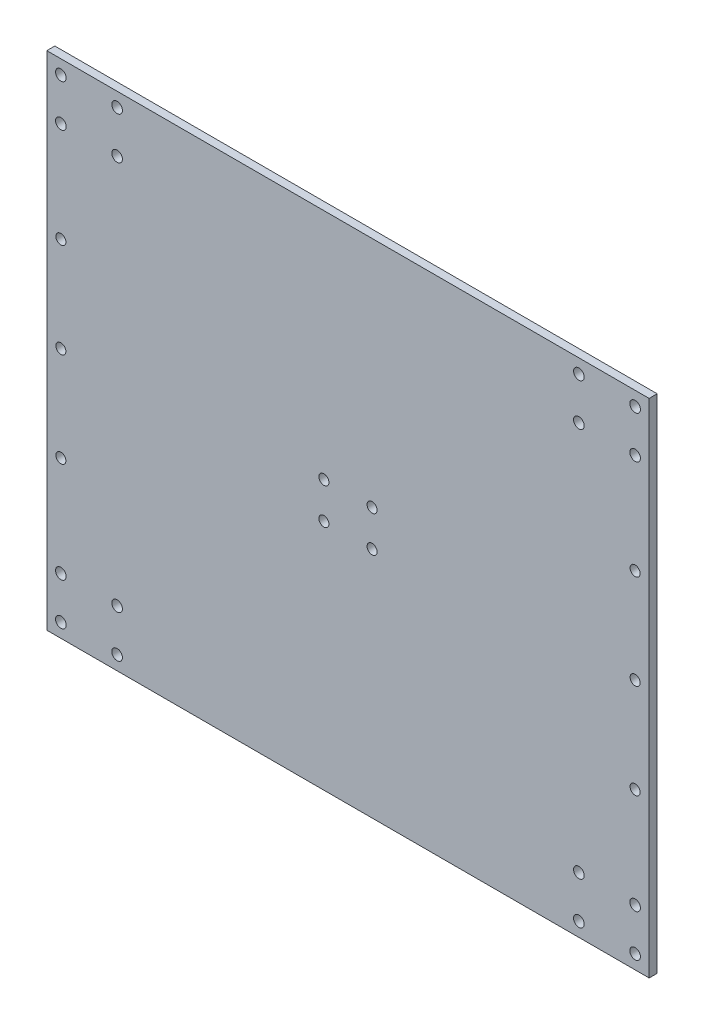
ISO-10303-21;
HEADER;
FILE_DESCRIPTION(('STEP AP214'),'2;1');
FILE_NAME('part.step','',(''),(''),'','','');
FILE_SCHEMA(('AUTOMOTIVE_DESIGN { 1 0 10303 214 1 1 1 1 }'));
ENDSEC;
DATA;
#1=APPLICATION_CONTEXT('core data for automotive mechanical design processes');
#2=APPLICATION_PROTOCOL_DEFINITION('international standard','automotive_design',2000,#1);
#3=PRODUCT_CONTEXT('',#1,'mechanical');
#4=PRODUCT('Part','Part','',(#3));
#5=PRODUCT_RELATED_PRODUCT_CATEGORY('part','',(#4));
#6=PRODUCT_DEFINITION_FORMATION('','',#4);
#7=PRODUCT_DEFINITION_CONTEXT('part definition',#1,'design');
#8=PRODUCT_DEFINITION('design','',#6,#7);
#9=PRODUCT_DEFINITION_SHAPE('','',#8);
#10=(LENGTH_UNIT() NAMED_UNIT(*) SI_UNIT(.MILLI.,.METRE.));
#11=(NAMED_UNIT(*) PLANE_ANGLE_UNIT() SI_UNIT($,.RADIAN.));
#12=(NAMED_UNIT(*) SI_UNIT($,.STERADIAN.) SOLID_ANGLE_UNIT());
#13=UNCERTAINTY_MEASURE_WITH_UNIT(LENGTH_MEASURE(1.E-05),#10,'distance_accuracy_value','');
#14=(GEOMETRIC_REPRESENTATION_CONTEXT(3) GLOBAL_UNCERTAINTY_ASSIGNED_CONTEXT((#13)) GLOBAL_UNIT_ASSIGNED_CONTEXT((#10,
#11,#12)) REPRESENTATION_CONTEXT('',''));
#15=CARTESIAN_POINT('',(0.,0.,0.));
#16=DIRECTION('',(0.,0.,1.));
#17=DIRECTION('',(1.,0.,0.));
#18=AXIS2_PLACEMENT_3D('',#15,#16,#17);
#19=CARTESIAN_POINT('',(0.,0.,4.));
#20=DIRECTION('',(0.,0.,-1.));
#21=DIRECTION('',(-1.,0.,0.));
#22=AXIS2_PLACEMENT_3D('',#19,#20,#21);
#23=PLANE('',#22);
#24=DIRECTION('',(0.,-1.,0.));
#25=VECTOR('',#24,1.);
#26=CARTESIAN_POINT('',(0.,0.,4.));
#27=LINE('',#26,#25);
#28=CARTESIAN_POINT('',(0.,250.,4.));
#29=VERTEX_POINT('',#28);
#30=CARTESIAN_POINT('',(0.,0.,4.));
#31=VERTEX_POINT('',#30);
#32=EDGE_CURVE('E88',#29,#31,#27,.T.);
#33=ORIENTED_EDGE('',*,*,#32,.T.);
#34=DIRECTION('',(1.,0.,0.));
#35=VECTOR('',#34,1.);
#36=CARTESIAN_POINT('',(0.,0.,4.));
#37=LINE('',#36,#35);
#38=CARTESIAN_POINT('',(300.000000000001,0.,4.));
#39=VERTEX_POINT('',#38);
#40=EDGE_CURVE('E83',#31,#39,#37,.T.);
#41=ORIENTED_EDGE('',*,*,#40,.T.);
#42=DIRECTION('',(0.,1.,0.));
#43=VECTOR('',#42,1.);
#44=CARTESIAN_POINT('',(300.000000000001,0.,4.));
#45=LINE('',#44,#43);
#46=CARTESIAN_POINT('',(300.000000000001,250.,4.));
#47=VERTEX_POINT('',#46);
#48=EDGE_CURVE('E86',#39,#47,#45,.T.);
#49=ORIENTED_EDGE('',*,*,#48,.T.);
#50=DIRECTION('',(-1.,0.,0.));
#51=VECTOR('',#50,1.);
#52=CARTESIAN_POINT('',(0.,250.,4.));
#53=LINE('',#52,#51);
#54=EDGE_CURVE('E53',#47,#29,#53,.T.);
#55=ORIENTED_EDGE('',*,*,#54,.T.);
#56=EDGE_LOOP('',(#33,#41,#49,#55));
#57=FACE_BOUND('',#56,.T.);
#58=CARTESIAN_POINT('',(293.000000000611,243.000000000048,4.));
#59=DIRECTION('',(0.,0.,1.));
#60=DIRECTION('',(1.,0.,0.));
#61=AXIS2_PLACEMENT_3D('',#58,#59,#60);
#62=CIRCLE('',#61,2.64999999944384);
#63=CARTESIAN_POINT('',(295.650000000055,243.000000000048,4.));
#64=VERTEX_POINT('',#63);
#65=EDGE_CURVE('E103',#64,#64,#62,.T.);
#66=ORIENTED_EDGE('',*,*,#65,.F.);
#67=EDGE_LOOP('',(#66));
#68=FACE_BOUND('',#67,.T.);
#69=CARTESIAN_POINT('',(265.000000000611,243.000000000048,4.));
#70=DIRECTION('',(0.,0.,1.));
#71=DIRECTION('',(1.,0.,0.));
#72=AXIS2_PLACEMENT_3D('',#69,#70,#71);
#73=CIRCLE('',#72,2.64999999944384);
#74=CARTESIAN_POINT('',(267.650000000055,243.000000000048,4.));
#75=VERTEX_POINT('',#74);
#76=EDGE_CURVE('E118',#75,#75,#73,.T.);
#77=ORIENTED_EDGE('',*,*,#76,.F.);
#78=EDGE_LOOP('',(#77));
#79=FACE_BOUND('',#78,.T.);
#80=CARTESIAN_POINT('',(265.000000000612,222.000000000048,4.));
#81=DIRECTION('',(0.,0.,1.));
#82=DIRECTION('',(1.,0.,0.));
#83=AXIS2_PLACEMENT_3D('',#80,#81,#82);
#84=CIRCLE('',#83,2.64999999944384);
#85=CARTESIAN_POINT('',(267.650000000055,222.000000000048,4.));
#86=VERTEX_POINT('',#85);
#87=EDGE_CURVE('E124',#86,#86,#84,.T.);
#88=ORIENTED_EDGE('',*,*,#87,.F.);
#89=EDGE_LOOP('',(#88));
#90=FACE_BOUND('',#89,.T.);
#91=CARTESIAN_POINT('',(293.000000000612,222.000000000048,4.));
#92=DIRECTION('',(0.,0.,1.));
#93=DIRECTION('',(1.,0.,0.));
#94=AXIS2_PLACEMENT_3D('',#91,#92,#93);
#95=CIRCLE('',#94,2.64999999944372);
#96=CARTESIAN_POINT('',(295.650000000055,222.000000000048,4.));
#97=VERTEX_POINT('',#96);
#98=EDGE_CURVE('E130',#97,#97,#95,.T.);
#99=ORIENTED_EDGE('',*,*,#98,.F.);
#100=EDGE_LOOP('',(#99));
#101=FACE_BOUND('',#100,.T.);
#102=CARTESIAN_POINT('',(35.0000000004003,243.,4.));
#103=DIRECTION('',(0.,0.,1.));
#104=DIRECTION('',(1.,0.,0.));
#105=AXIS2_PLACEMENT_3D('',#102,#103,#104);
#106=CIRCLE('',#105,2.64999999964641);
#107=CARTESIAN_POINT('',(37.6500000000467,243.,4.));
#108=VERTEX_POINT('',#107);
#109=EDGE_CURVE('E136',#108,#108,#106,.T.);
#110=ORIENTED_EDGE('',*,*,#109,.F.);
#111=EDGE_LOOP('',(#110));
#112=FACE_BOUND('',#111,.T.);
#113=CARTESIAN_POINT('',(7.00000000040029,243.,4.));
#114=DIRECTION('',(0.,0.,1.));
#115=DIRECTION('',(1.,0.,0.));
#116=AXIS2_PLACEMENT_3D('',#113,#114,#115);
#117=CIRCLE('',#116,2.64999999964631);
#118=CARTESIAN_POINT('',(9.65000000004659,243.,4.));
#119=VERTEX_POINT('',#118);
#120=EDGE_CURVE('E142',#119,#119,#117,.T.);
#121=ORIENTED_EDGE('',*,*,#120,.F.);
#122=EDGE_LOOP('',(#121));
#123=FACE_BOUND('',#122,.T.);
#124=CARTESIAN_POINT('',(7.00000000040028,222.,4.));
#125=DIRECTION('',(0.,0.,1.));
#126=DIRECTION('',(1.,0.,0.));
#127=AXIS2_PLACEMENT_3D('',#124,#125,#126);
#128=CIRCLE('',#127,2.64999999964628);
#129=CARTESIAN_POINT('',(9.65000000004656,222.,4.));
#130=VERTEX_POINT('',#129);
#131=EDGE_CURVE('E148',#130,#130,#128,.T.);
#132=ORIENTED_EDGE('',*,*,#131,.F.);
#133=EDGE_LOOP('',(#132));
#134=FACE_BOUND('',#133,.T.);
#135=CARTESIAN_POINT('',(35.0000000004003,222.,4.));
#136=DIRECTION('',(0.,0.,1.));
#137=DIRECTION('',(1.,0.,0.));
#138=AXIS2_PLACEMENT_3D('',#135,#136,#137);
#139=CIRCLE('',#138,2.64999999964628);
#140=CARTESIAN_POINT('',(37.6500000000466,222.,4.));
#141=VERTEX_POINT('',#140);
#142=EDGE_CURVE('E154',#141,#141,#139,.T.);
#143=ORIENTED_EDGE('',*,*,#142,.F.);
#144=EDGE_LOOP('',(#143));
#145=FACE_BOUND('',#144,.T.);
#146=CARTESIAN_POINT('',(7.00000000040292,28.0000000000002,4.));
#147=DIRECTION('',(0.,0.,1.));
#148=DIRECTION('',(1.,0.,0.));
#149=AXIS2_PLACEMENT_3D('',#146,#147,#148);
#150=CIRCLE('',#149,2.6499999996439);
#151=CARTESIAN_POINT('',(9.65000000004682,28.0000000000002,4.));
#152=VERTEX_POINT('',#151);
#153=EDGE_CURVE('E160',#152,#152,#150,.T.);
#154=ORIENTED_EDGE('',*,*,#153,.F.);
#155=EDGE_LOOP('',(#154));
#156=FACE_BOUND('',#155,.T.);
#157=CARTESIAN_POINT('',(7.00000000040292,7.00000000000018,4.));
#158=DIRECTION('',(0.,0.,1.));
#159=DIRECTION('',(1.,0.,0.));
#160=AXIS2_PLACEMENT_3D('',#157,#158,#159);
#161=CIRCLE('',#160,2.6499999996439);
#162=CARTESIAN_POINT('',(9.65000000004682,7.00000000000018,4.));
#163=VERTEX_POINT('',#162);
#164=EDGE_CURVE('E166',#163,#163,#161,.T.);
#165=ORIENTED_EDGE('',*,*,#164,.F.);
#166=EDGE_LOOP('',(#165));
#167=FACE_BOUND('',#166,.T.);
#168=CARTESIAN_POINT('',(35.0000000004029,7.00000000000017,4.));
#169=DIRECTION('',(0.,0.,1.));
#170=DIRECTION('',(1.,0.,0.));
#171=AXIS2_PLACEMENT_3D('',#168,#169,#170);
#172=CIRCLE('',#171,2.6499999996438);
#173=CARTESIAN_POINT('',(37.6500000000467,7.00000000000017,4.));
#174=VERTEX_POINT('',#173);
#175=EDGE_CURVE('E172',#174,#174,#172,.T.);
#176=ORIENTED_EDGE('',*,*,#175,.F.);
#177=EDGE_LOOP('',(#176));
#178=FACE_BOUND('',#177,.T.);
#179=CARTESIAN_POINT('',(35.0000000004029,28.0000000000002,4.));
#180=DIRECTION('',(0.,0.,1.));
#181=DIRECTION('',(1.,0.,0.));
#182=AXIS2_PLACEMENT_3D('',#179,#180,#181);
#183=CIRCLE('',#182,2.6499999996439);
#184=CARTESIAN_POINT('',(37.6500000000468,28.0000000000002,4.));
#185=VERTEX_POINT('',#184);
#186=EDGE_CURVE('E178',#185,#185,#183,.T.);
#187=ORIENTED_EDGE('',*,*,#186,.F.);
#188=EDGE_LOOP('',(#187));
#189=FACE_BOUND('',#188,.T.);
#190=CARTESIAN_POINT('',(265.000000000404,28.0000000000002,4.));
#191=DIRECTION('',(0.,0.,1.));
#192=DIRECTION('',(1.,0.,0.));
#193=AXIS2_PLACEMENT_3D('',#190,#191,#192);
#194=CIRCLE('',#193,2.64999999964333);
#195=CARTESIAN_POINT('',(267.650000000047,28.0000000000002,4.));
#196=VERTEX_POINT('',#195);
#197=EDGE_CURVE('E184',#196,#196,#194,.T.);
#198=ORIENTED_EDGE('',*,*,#197,.F.);
#199=EDGE_LOOP('',(#198));
#200=FACE_BOUND('',#199,.T.);
#201=CARTESIAN_POINT('',(265.000000000404,7.00000000000018,4.));
#202=DIRECTION('',(0.,0.,1.));
#203=DIRECTION('',(1.,0.,0.));
#204=AXIS2_PLACEMENT_3D('',#201,#202,#203);
#205=CIRCLE('',#204,2.64999999964332);
#206=CARTESIAN_POINT('',(267.650000000047,7.00000000000018,4.));
#207=VERTEX_POINT('',#206);
#208=EDGE_CURVE('E190',#207,#207,#205,.T.);
#209=ORIENTED_EDGE('',*,*,#208,.F.);
#210=EDGE_LOOP('',(#209));
#211=FACE_BOUND('',#210,.T.);
#212=CARTESIAN_POINT('',(293.000000000403,7.00000000000018,4.));
#213=DIRECTION('',(0.,0.,1.));
#214=DIRECTION('',(1.,0.,0.));
#215=AXIS2_PLACEMENT_3D('',#212,#213,#214);
#216=CIRCLE('',#215,2.64999999964349);
#217=CARTESIAN_POINT('',(295.650000000047,7.00000000000018,4.));
#218=VERTEX_POINT('',#217);
#219=EDGE_CURVE('E196',#218,#218,#216,.T.);
#220=ORIENTED_EDGE('',*,*,#219,.F.);
#221=EDGE_LOOP('',(#220));
#222=FACE_BOUND('',#221,.T.);
#223=CARTESIAN_POINT('',(293.000000000403,28.0000000000002,4.));
#224=DIRECTION('',(0.,0.,1.));
#225=DIRECTION('',(1.,0.,0.));
#226=AXIS2_PLACEMENT_3D('',#223,#224,#225);
#227=CIRCLE('',#226,2.64999999964349);
#228=CARTESIAN_POINT('',(295.650000000047,28.0000000000002,4.));
#229=VERTEX_POINT('',#228);
#230=EDGE_CURVE('E202',#229,#229,#227,.T.);
#231=ORIENTED_EDGE('',*,*,#230,.F.);
#232=EDGE_LOOP('',(#231));
#233=FACE_BOUND('',#232,.T.);
#234=CARTESIAN_POINT('',(162.000000000066,134.,4.));
#235=DIRECTION('',(0.,0.,1.));
#236=DIRECTION('',(1.,0.,0.));
#237=AXIS2_PLACEMENT_3D('',#234,#235,#236);
#238=CIRCLE('',#237,2.4999999999388);
#239=CARTESIAN_POINT('',(164.500000000005,134.,4.));
#240=VERTEX_POINT('',#239);
#241=EDGE_CURVE('E208',#240,#240,#238,.T.);
#242=ORIENTED_EDGE('',*,*,#241,.F.);
#243=EDGE_LOOP('',(#242));
#244=FACE_BOUND('',#243,.T.);
#245=CARTESIAN_POINT('',(138.000000000066,134.,4.));
#246=DIRECTION('',(0.,0.,1.));
#247=DIRECTION('',(1.,0.,0.));
#248=AXIS2_PLACEMENT_3D('',#245,#246,#247);
#249=CIRCLE('',#248,2.49999999993801);
#250=CARTESIAN_POINT('',(140.500000000004,134.,4.));
#251=VERTEX_POINT('',#250);
#252=EDGE_CURVE('E214',#251,#251,#249,.T.);
#253=ORIENTED_EDGE('',*,*,#252,.F.);
#254=EDGE_LOOP('',(#253));
#255=FACE_BOUND('',#254,.T.);
#256=CARTESIAN_POINT('',(138.000000000066,116.,4.));
#257=DIRECTION('',(0.,0.,1.));
#258=DIRECTION('',(1.,0.,0.));
#259=AXIS2_PLACEMENT_3D('',#256,#257,#258);
#260=CIRCLE('',#259,2.49999999993862);
#261=CARTESIAN_POINT('',(140.500000000004,116.,4.));
#262=VERTEX_POINT('',#261);
#263=EDGE_CURVE('E220',#262,#262,#260,.T.);
#264=ORIENTED_EDGE('',*,*,#263,.F.);
#265=EDGE_LOOP('',(#264));
#266=FACE_BOUND('',#265,.T.);
#267=CARTESIAN_POINT('',(161.999999999865,115.999999999977,4.));
#268=DIRECTION('',(0.,0.,1.));
#269=DIRECTION('',(1.,0.,0.));
#270=AXIS2_PLACEMENT_3D('',#267,#268,#269);
#271=CIRCLE('',#270,2.50000000013431);
#272=CARTESIAN_POINT('',(164.499999999999,115.999999999977,4.));
#273=VERTEX_POINT('',#272);
#274=EDGE_CURVE('E226',#273,#273,#271,.T.);
#275=ORIENTED_EDGE('',*,*,#274,.F.);
#276=EDGE_LOOP('',(#275));
#277=FACE_BOUND('',#276,.T.);
#278=CARTESIAN_POINT('',(7.00000000000455,125.,4.));
#279=DIRECTION('',(0.,0.,1.));
#280=DIRECTION('',(1.,0.,0.));
#281=AXIS2_PLACEMENT_3D('',#278,#279,#280);
#282=CIRCLE('',#281,2.5);
#283=CARTESIAN_POINT('',(9.50000000000455,125.,4.));
#284=VERTEX_POINT('',#283);
#285=EDGE_CURVE('E232',#284,#284,#282,.T.);
#286=ORIENTED_EDGE('',*,*,#285,.F.);
#287=EDGE_LOOP('',(#286));
#288=FACE_BOUND('',#287,.T.);
#289=CARTESIAN_POINT('',(7.00000000000456,77.8250000000123,4.));
#290=DIRECTION('',(0.,0.,1.));
#291=DIRECTION('',(1.,0.,0.));
#292=AXIS2_PLACEMENT_3D('',#289,#290,#291);
#293=CIRCLE('',#292,2.5);
#294=CARTESIAN_POINT('',(9.50000000000456,77.8250000000123,4.));
#295=VERTEX_POINT('',#294);
#296=EDGE_CURVE('E238',#295,#295,#293,.T.);
#297=ORIENTED_EDGE('',*,*,#296,.F.);
#298=EDGE_LOOP('',(#297));
#299=FACE_BOUND('',#298,.T.);
#300=CARTESIAN_POINT('',(7.00000000000453,172.174999999988,4.));
#301=DIRECTION('',(0.,0.,1.));
#302=DIRECTION('',(1.,0.,0.));
#303=AXIS2_PLACEMENT_3D('',#300,#301,#302);
#304=CIRCLE('',#303,2.5);
#305=CARTESIAN_POINT('',(9.50000000000453,172.174999999988,4.));
#306=VERTEX_POINT('',#305);
#307=EDGE_CURVE('E244',#306,#306,#304,.T.);
#308=ORIENTED_EDGE('',*,*,#307,.F.);
#309=EDGE_LOOP('',(#308));
#310=FACE_BOUND('',#309,.T.);
#311=CARTESIAN_POINT('',(293.000000000007,125.,4.));
#312=DIRECTION('',(0.,0.,1.));
#313=DIRECTION('',(1.,0.,0.));
#314=AXIS2_PLACEMENT_3D('',#311,#312,#313);
#315=CIRCLE('',#314,2.50000000000002);
#316=CARTESIAN_POINT('',(295.500000000007,125.,4.));
#317=VERTEX_POINT('',#316);
#318=EDGE_CURVE('E250',#317,#317,#315,.T.);
#319=ORIENTED_EDGE('',*,*,#318,.F.);
#320=EDGE_LOOP('',(#319));
#321=FACE_BOUND('',#320,.T.);
#322=CARTESIAN_POINT('',(293.000000000007,77.8250000000123,4.));
#323=DIRECTION('',(0.,0.,1.));
#324=DIRECTION('',(1.,0.,0.));
#325=AXIS2_PLACEMENT_3D('',#322,#323,#324);
#326=CIRCLE('',#325,2.50000000000002);
#327=CARTESIAN_POINT('',(295.500000000007,77.8250000000123,4.));
#328=VERTEX_POINT('',#327);
#329=EDGE_CURVE('E256',#328,#328,#326,.T.);
#330=ORIENTED_EDGE('',*,*,#329,.F.);
#331=EDGE_LOOP('',(#330));
#332=FACE_BOUND('',#331,.T.);
#333=CARTESIAN_POINT('',(293.000000000007,172.174999999988,4.));
#334=DIRECTION('',(0.,0.,1.));
#335=DIRECTION('',(1.,0.,0.));
#336=AXIS2_PLACEMENT_3D('',#333,#334,#335);
#337=CIRCLE('',#336,2.50000000000002);
#338=CARTESIAN_POINT('',(295.500000000007,172.174999999988,4.));
#339=VERTEX_POINT('',#338);
#340=EDGE_CURVE('E262',#339,#339,#337,.T.);
#341=ORIENTED_EDGE('',*,*,#340,.F.);
#342=EDGE_LOOP('',(#341));
#343=FACE_BOUND('',#342,.T.);
#344=ADVANCED_FACE('F36',(#57,#68,#79,#90,#101,#112,#123,#134,#145,#156,#167,#178,#189,#200,
#211,#222,#233,#244,#255,#266,#277,#288,#299,#310,#321,#332,#343),#23,.F.);
#345=CARTESIAN_POINT('',(0.,0.,0.));
#346=DIRECTION('',(0.,0.,-1.));
#347=DIRECTION('',(-1.,0.,0.));
#348=AXIS2_PLACEMENT_3D('',#345,#346,#347);
#349=PLANE('',#348);
#350=CARTESIAN_POINT('',(293.000000000007,77.8250000000123,0.));
#351=DIRECTION('',(0.,0.,1.));
#352=DIRECTION('',(1.,0.,0.));
#353=AXIS2_PLACEMENT_3D('',#350,#351,#352);
#354=CIRCLE('',#353,2.50000000000002);
#355=CARTESIAN_POINT('',(295.500000000007,77.8250000000123,0.));
#356=VERTEX_POINT('',#355);
#357=EDGE_CURVE('E259',#356,#356,#354,.T.);
#358=ORIENTED_EDGE('',*,*,#357,.T.);
#359=EDGE_LOOP('',(#358));
#360=FACE_BOUND('',#359,.T.);
#361=CARTESIAN_POINT('',(7.00000000000453,172.174999999988,0.));
#362=DIRECTION('',(0.,0.,1.));
#363=DIRECTION('',(1.,0.,0.));
#364=AXIS2_PLACEMENT_3D('',#361,#362,#363);
#365=CIRCLE('',#364,2.5);
#366=CARTESIAN_POINT('',(9.50000000000453,172.174999999988,0.));
#367=VERTEX_POINT('',#366);
#368=EDGE_CURVE('E247',#367,#367,#365,.T.);
#369=ORIENTED_EDGE('',*,*,#368,.T.);
#370=EDGE_LOOP('',(#369));
#371=FACE_BOUND('',#370,.T.);
#372=CARTESIAN_POINT('',(7.00000000000455,125.,0.));
#373=DIRECTION('',(0.,0.,1.));
#374=DIRECTION('',(1.,0.,0.));
#375=AXIS2_PLACEMENT_3D('',#372,#373,#374);
#376=CIRCLE('',#375,2.5);
#377=CARTESIAN_POINT('',(9.50000000000455,125.,0.));
#378=VERTEX_POINT('',#377);
#379=EDGE_CURVE('E235',#378,#378,#376,.T.);
#380=ORIENTED_EDGE('',*,*,#379,.T.);
#381=EDGE_LOOP('',(#380));
#382=FACE_BOUND('',#381,.T.);
#383=CARTESIAN_POINT('',(138.000000000066,116.,0.));
#384=DIRECTION('',(0.,0.,1.));
#385=DIRECTION('',(1.,0.,0.));
#386=AXIS2_PLACEMENT_3D('',#383,#384,#385);
#387=CIRCLE('',#386,2.49999999993862);
#388=CARTESIAN_POINT('',(140.500000000004,116.,0.));
#389=VERTEX_POINT('',#388);
#390=EDGE_CURVE('E223',#389,#389,#387,.T.);
#391=ORIENTED_EDGE('',*,*,#390,.T.);
#392=EDGE_LOOP('',(#391));
#393=FACE_BOUND('',#392,.T.);
#394=CARTESIAN_POINT('',(162.000000000066,134.,0.));
#395=DIRECTION('',(0.,0.,1.));
#396=DIRECTION('',(1.,0.,0.));
#397=AXIS2_PLACEMENT_3D('',#394,#395,#396);
#398=CIRCLE('',#397,2.4999999999388);
#399=CARTESIAN_POINT('',(164.500000000005,134.,0.));
#400=VERTEX_POINT('',#399);
#401=EDGE_CURVE('E211',#400,#400,#398,.T.);
#402=ORIENTED_EDGE('',*,*,#401,.T.);
#403=EDGE_LOOP('',(#402));
#404=FACE_BOUND('',#403,.T.);
#405=CARTESIAN_POINT('',(293.000000000403,7.00000000000018,0.));
#406=DIRECTION('',(0.,0.,1.));
#407=DIRECTION('',(1.,0.,0.));
#408=AXIS2_PLACEMENT_3D('',#405,#406,#407);
#409=CIRCLE('',#408,2.64999999964349);
#410=CARTESIAN_POINT('',(295.650000000047,7.00000000000018,0.));
#411=VERTEX_POINT('',#410);
#412=EDGE_CURVE('E199',#411,#411,#409,.T.);
#413=ORIENTED_EDGE('',*,*,#412,.T.);
#414=EDGE_LOOP('',(#413));
#415=FACE_BOUND('',#414,.T.);
#416=CARTESIAN_POINT('',(265.000000000404,28.0000000000002,0.));
#417=DIRECTION('',(0.,0.,1.));
#418=DIRECTION('',(1.,0.,0.));
#419=AXIS2_PLACEMENT_3D('',#416,#417,#418);
#420=CIRCLE('',#419,2.64999999964333);
#421=CARTESIAN_POINT('',(267.650000000047,28.0000000000002,0.));
#422=VERTEX_POINT('',#421);
#423=EDGE_CURVE('E187',#422,#422,#420,.T.);
#424=ORIENTED_EDGE('',*,*,#423,.T.);
#425=EDGE_LOOP('',(#424));
#426=FACE_BOUND('',#425,.T.);
#427=CARTESIAN_POINT('',(35.0000000004029,7.00000000000017,0.));
#428=DIRECTION('',(0.,0.,1.));
#429=DIRECTION('',(1.,0.,0.));
#430=AXIS2_PLACEMENT_3D('',#427,#428,#429);
#431=CIRCLE('',#430,2.6499999996438);
#432=CARTESIAN_POINT('',(37.6500000000467,7.00000000000017,0.));
#433=VERTEX_POINT('',#432);
#434=EDGE_CURVE('E175',#433,#433,#431,.T.);
#435=ORIENTED_EDGE('',*,*,#434,.T.);
#436=EDGE_LOOP('',(#435));
#437=FACE_BOUND('',#436,.T.);
#438=CARTESIAN_POINT('',(7.00000000040292,28.0000000000002,0.));
#439=DIRECTION('',(0.,0.,1.));
#440=DIRECTION('',(1.,0.,0.));
#441=AXIS2_PLACEMENT_3D('',#438,#439,#440);
#442=CIRCLE('',#441,2.6499999996439);
#443=CARTESIAN_POINT('',(9.65000000004682,28.0000000000002,0.));
#444=VERTEX_POINT('',#443);
#445=EDGE_CURVE('E163',#444,#444,#442,.T.);
#446=ORIENTED_EDGE('',*,*,#445,.T.);
#447=EDGE_LOOP('',(#446));
#448=FACE_BOUND('',#447,.T.);
#449=CARTESIAN_POINT('',(7.00000000040028,222.,0.));
#450=DIRECTION('',(0.,0.,1.));
#451=DIRECTION('',(1.,0.,0.));
#452=AXIS2_PLACEMENT_3D('',#449,#450,#451);
#453=CIRCLE('',#452,2.64999999964628);
#454=CARTESIAN_POINT('',(9.65000000004656,222.,0.));
#455=VERTEX_POINT('',#454);
#456=EDGE_CURVE('E151',#455,#455,#453,.T.);
#457=ORIENTED_EDGE('',*,*,#456,.T.);
#458=EDGE_LOOP('',(#457));
#459=FACE_BOUND('',#458,.T.);
#460=CARTESIAN_POINT('',(35.0000000004003,243.,0.));
#461=DIRECTION('',(0.,0.,1.));
#462=DIRECTION('',(1.,0.,0.));
#463=AXIS2_PLACEMENT_3D('',#460,#461,#462);
#464=CIRCLE('',#463,2.64999999964641);
#465=CARTESIAN_POINT('',(37.6500000000467,243.,0.));
#466=VERTEX_POINT('',#465);
#467=EDGE_CURVE('E139',#466,#466,#464,.T.);
#468=ORIENTED_EDGE('',*,*,#467,.T.);
#469=EDGE_LOOP('',(#468));
#470=FACE_BOUND('',#469,.T.);
#471=CARTESIAN_POINT('',(265.000000000612,222.000000000048,0.));
#472=DIRECTION('',(0.,0.,1.));
#473=DIRECTION('',(1.,0.,0.));
#474=AXIS2_PLACEMENT_3D('',#471,#472,#473);
#475=CIRCLE('',#474,2.64999999944384);
#476=CARTESIAN_POINT('',(267.650000000055,222.000000000048,0.));
#477=VERTEX_POINT('',#476);
#478=EDGE_CURVE('E127',#477,#477,#475,.T.);
#479=ORIENTED_EDGE('',*,*,#478,.T.);
#480=EDGE_LOOP('',(#479));
#481=FACE_BOUND('',#480,.T.);
#482=CARTESIAN_POINT('',(293.000000000611,243.000000000048,0.));
#483=DIRECTION('',(0.,0.,1.));
#484=DIRECTION('',(1.,0.,0.));
#485=AXIS2_PLACEMENT_3D('',#482,#483,#484);
#486=CIRCLE('',#485,2.64999999944384);
#487=CARTESIAN_POINT('',(295.650000000055,243.000000000048,0.));
#488=VERTEX_POINT('',#487);
#489=EDGE_CURVE('E115',#488,#488,#486,.T.);
#490=ORIENTED_EDGE('',*,*,#489,.T.);
#491=EDGE_LOOP('',(#490));
#492=FACE_BOUND('',#491,.T.);
#493=DIRECTION('',(0.,-1.,0.));
#494=VECTOR('',#493,1.);
#495=CARTESIAN_POINT('',(0.,0.,0.));
#496=LINE('',#495,#494);
#497=CARTESIAN_POINT('',(0.,250.,0.));
#498=VERTEX_POINT('',#497);
#499=CARTESIAN_POINT('',(0.,0.,0.));
#500=VERTEX_POINT('',#499);
#501=EDGE_CURVE('E100',#498,#500,#496,.T.);
#502=ORIENTED_EDGE('',*,*,#501,.F.);
#503=DIRECTION('',(-1.,0.,0.));
#504=VECTOR('',#503,1.);
#505=CARTESIAN_POINT('',(0.,250.,0.));
#506=LINE('',#505,#504);
#507=CARTESIAN_POINT('',(300.000000000001,250.,0.));
#508=VERTEX_POINT('',#507);
#509=EDGE_CURVE('E76',#508,#498,#506,.T.);
#510=ORIENTED_EDGE('',*,*,#509,.F.);
#511=DIRECTION('',(0.,1.,0.));
#512=VECTOR('',#511,1.);
#513=CARTESIAN_POINT('',(300.000000000001,0.,0.));
#514=LINE('',#513,#512);
#515=CARTESIAN_POINT('',(300.000000000001,0.,0.));
#516=VERTEX_POINT('',#515);
#517=EDGE_CURVE('E70',#516,#508,#514,.T.);
#518=ORIENTED_EDGE('',*,*,#517,.F.);
#519=DIRECTION('',(1.,0.,0.));
#520=VECTOR('',#519,1.);
#521=CARTESIAN_POINT('',(0.,0.,0.));
#522=LINE('',#521,#520);
#523=EDGE_CURVE('E92',#500,#516,#522,.T.);
#524=ORIENTED_EDGE('',*,*,#523,.F.);
#525=EDGE_LOOP('',(#502,#510,#518,#524));
#526=FACE_BOUND('',#525,.T.);
#527=CARTESIAN_POINT('',(265.000000000611,243.000000000048,0.));
#528=DIRECTION('',(0.,0.,1.));
#529=DIRECTION('',(1.,0.,0.));
#530=AXIS2_PLACEMENT_3D('',#527,#528,#529);
#531=CIRCLE('',#530,2.64999999944384);
#532=CARTESIAN_POINT('',(267.650000000055,243.000000000048,0.));
#533=VERTEX_POINT('',#532);
#534=EDGE_CURVE('E121',#533,#533,#531,.T.);
#535=ORIENTED_EDGE('',*,*,#534,.T.);
#536=EDGE_LOOP('',(#535));
#537=FACE_BOUND('',#536,.T.);
#538=CARTESIAN_POINT('',(293.000000000612,222.000000000048,0.));
#539=DIRECTION('',(0.,0.,1.));
#540=DIRECTION('',(1.,0.,0.));
#541=AXIS2_PLACEMENT_3D('',#538,#539,#540);
#542=CIRCLE('',#541,2.64999999944372);
#543=CARTESIAN_POINT('',(295.650000000055,222.000000000048,0.));
#544=VERTEX_POINT('',#543);
#545=EDGE_CURVE('E133',#544,#544,#542,.T.);
#546=ORIENTED_EDGE('',*,*,#545,.T.);
#547=EDGE_LOOP('',(#546));
#548=FACE_BOUND('',#547,.T.);
#549=CARTESIAN_POINT('',(7.00000000040029,243.,0.));
#550=DIRECTION('',(0.,0.,1.));
#551=DIRECTION('',(1.,0.,0.));
#552=AXIS2_PLACEMENT_3D('',#549,#550,#551);
#553=CIRCLE('',#552,2.64999999964631);
#554=CARTESIAN_POINT('',(9.65000000004659,243.,0.));
#555=VERTEX_POINT('',#554);
#556=EDGE_CURVE('E145',#555,#555,#553,.T.);
#557=ORIENTED_EDGE('',*,*,#556,.T.);
#558=EDGE_LOOP('',(#557));
#559=FACE_BOUND('',#558,.T.);
#560=CARTESIAN_POINT('',(35.0000000004003,222.,0.));
#561=DIRECTION('',(0.,0.,1.));
#562=DIRECTION('',(1.,0.,0.));
#563=AXIS2_PLACEMENT_3D('',#560,#561,#562);
#564=CIRCLE('',#563,2.64999999964628);
#565=CARTESIAN_POINT('',(37.6500000000466,222.,0.));
#566=VERTEX_POINT('',#565);
#567=EDGE_CURVE('E157',#566,#566,#564,.T.);
#568=ORIENTED_EDGE('',*,*,#567,.T.);
#569=EDGE_LOOP('',(#568));
#570=FACE_BOUND('',#569,.T.);
#571=CARTESIAN_POINT('',(7.00000000040292,7.00000000000018,0.));
#572=DIRECTION('',(0.,0.,1.));
#573=DIRECTION('',(1.,0.,0.));
#574=AXIS2_PLACEMENT_3D('',#571,#572,#573);
#575=CIRCLE('',#574,2.6499999996439);
#576=CARTESIAN_POINT('',(9.65000000004682,7.00000000000018,0.));
#577=VERTEX_POINT('',#576);
#578=EDGE_CURVE('E169',#577,#577,#575,.T.);
#579=ORIENTED_EDGE('',*,*,#578,.T.);
#580=EDGE_LOOP('',(#579));
#581=FACE_BOUND('',#580,.T.);
#582=CARTESIAN_POINT('',(35.0000000004029,28.0000000000002,0.));
#583=DIRECTION('',(0.,0.,1.));
#584=DIRECTION('',(1.,0.,0.));
#585=AXIS2_PLACEMENT_3D('',#582,#583,#584);
#586=CIRCLE('',#585,2.6499999996439);
#587=CARTESIAN_POINT('',(37.6500000000468,28.0000000000002,0.));
#588=VERTEX_POINT('',#587);
#589=EDGE_CURVE('E181',#588,#588,#586,.T.);
#590=ORIENTED_EDGE('',*,*,#589,.T.);
#591=EDGE_LOOP('',(#590));
#592=FACE_BOUND('',#591,.T.);
#593=CARTESIAN_POINT('',(265.000000000404,7.00000000000018,0.));
#594=DIRECTION('',(0.,0.,1.));
#595=DIRECTION('',(1.,0.,0.));
#596=AXIS2_PLACEMENT_3D('',#593,#594,#595);
#597=CIRCLE('',#596,2.64999999964332);
#598=CARTESIAN_POINT('',(267.650000000047,7.00000000000018,0.));
#599=VERTEX_POINT('',#598);
#600=EDGE_CURVE('E193',#599,#599,#597,.T.);
#601=ORIENTED_EDGE('',*,*,#600,.T.);
#602=EDGE_LOOP('',(#601));
#603=FACE_BOUND('',#602,.T.);
#604=CARTESIAN_POINT('',(293.000000000403,28.0000000000002,0.));
#605=DIRECTION('',(0.,0.,1.));
#606=DIRECTION('',(1.,0.,0.));
#607=AXIS2_PLACEMENT_3D('',#604,#605,#606);
#608=CIRCLE('',#607,2.64999999964349);
#609=CARTESIAN_POINT('',(295.650000000047,28.0000000000002,0.));
#610=VERTEX_POINT('',#609);
#611=EDGE_CURVE('E205',#610,#610,#608,.T.);
#612=ORIENTED_EDGE('',*,*,#611,.T.);
#613=EDGE_LOOP('',(#612));
#614=FACE_BOUND('',#613,.T.);
#615=CARTESIAN_POINT('',(138.000000000066,134.,0.));
#616=DIRECTION('',(0.,0.,1.));
#617=DIRECTION('',(1.,0.,0.));
#618=AXIS2_PLACEMENT_3D('',#615,#616,#617);
#619=CIRCLE('',#618,2.49999999993801);
#620=CARTESIAN_POINT('',(140.500000000004,134.,0.));
#621=VERTEX_POINT('',#620);
#622=EDGE_CURVE('E217',#621,#621,#619,.T.);
#623=ORIENTED_EDGE('',*,*,#622,.T.);
#624=EDGE_LOOP('',(#623));
#625=FACE_BOUND('',#624,.T.);
#626=CARTESIAN_POINT('',(161.999999999865,115.999999999977,0.));
#627=DIRECTION('',(0.,0.,1.));
#628=DIRECTION('',(1.,0.,0.));
#629=AXIS2_PLACEMENT_3D('',#626,#627,#628);
#630=CIRCLE('',#629,2.50000000013431);
#631=CARTESIAN_POINT('',(164.499999999999,115.999999999977,0.));
#632=VERTEX_POINT('',#631);
#633=EDGE_CURVE('E229',#632,#632,#630,.T.);
#634=ORIENTED_EDGE('',*,*,#633,.T.);
#635=EDGE_LOOP('',(#634));
#636=FACE_BOUND('',#635,.T.);
#637=CARTESIAN_POINT('',(7.00000000000456,77.8250000000123,0.));
#638=DIRECTION('',(0.,0.,1.));
#639=DIRECTION('',(1.,0.,0.));
#640=AXIS2_PLACEMENT_3D('',#637,#638,#639);
#641=CIRCLE('',#640,2.5);
#642=CARTESIAN_POINT('',(9.50000000000456,77.8250000000123,0.));
#643=VERTEX_POINT('',#642);
#644=EDGE_CURVE('E241',#643,#643,#641,.T.);
#645=ORIENTED_EDGE('',*,*,#644,.T.);
#646=EDGE_LOOP('',(#645));
#647=FACE_BOUND('',#646,.T.);
#648=CARTESIAN_POINT('',(293.000000000007,125.,0.));
#649=DIRECTION('',(0.,0.,1.));
#650=DIRECTION('',(1.,0.,0.));
#651=AXIS2_PLACEMENT_3D('',#648,#649,#650);
#652=CIRCLE('',#651,2.50000000000002);
#653=CARTESIAN_POINT('',(295.500000000007,125.,0.));
#654=VERTEX_POINT('',#653);
#655=EDGE_CURVE('E253',#654,#654,#652,.T.);
#656=ORIENTED_EDGE('',*,*,#655,.T.);
#657=EDGE_LOOP('',(#656));
#658=FACE_BOUND('',#657,.T.);
#659=CARTESIAN_POINT('',(293.000000000007,172.174999999988,0.));
#660=DIRECTION('',(0.,0.,1.));
#661=DIRECTION('',(1.,0.,0.));
#662=AXIS2_PLACEMENT_3D('',#659,#660,#661);
#663=CIRCLE('',#662,2.50000000000002);
#664=CARTESIAN_POINT('',(295.500000000007,172.174999999988,0.));
#665=VERTEX_POINT('',#664);
#666=EDGE_CURVE('E265',#665,#665,#663,.T.);
#667=ORIENTED_EDGE('',*,*,#666,.T.);
#668=EDGE_LOOP('',(#667));
#669=FACE_BOUND('',#668,.T.);
#670=ADVANCED_FACE('F111',(#360,#371,#382,#393,#404,#415,#426,#437,#448,#459,#470,#481,#492,
#526,#537,#548,#559,#570,#581,#592,#603,#614,#625,#636,#647,#658,#669),#349,.T.);
#671=CARTESIAN_POINT('',(0.,0.,4.));
#672=DIRECTION('',(1.,0.,0.));
#673=DIRECTION('',(0.,0.,-1.));
#674=AXIS2_PLACEMENT_3D('',#671,#672,#673);
#675=PLANE('',#674);
#676=ORIENTED_EDGE('',*,*,#501,.T.);
#677=DIRECTION('',(0.,0.,-1.));
#678=VECTOR('',#677,1.);
#679=CARTESIAN_POINT('',(0.,0.,4.));
#680=LINE('',#679,#678);
#681=EDGE_CURVE('E11',#31,#500,#680,.T.);
#682=ORIENTED_EDGE('',*,*,#681,.F.);
#683=ORIENTED_EDGE('',*,*,#32,.F.);
#684=DIRECTION('',(0.,0.,-1.));
#685=VECTOR('',#684,1.);
#686=CARTESIAN_POINT('',(0.,250.,4.));
#687=LINE('',#686,#685);
#688=EDGE_CURVE('E96',#29,#498,#687,.T.);
#689=ORIENTED_EDGE('',*,*,#688,.T.);
#690=EDGE_LOOP('',(#676,#682,#683,#689));
#691=FACE_BOUND('',#690,.T.);
#692=ADVANCED_FACE('F38',(#691),#675,.F.);
#693=CARTESIAN_POINT('',(0.,0.,4.));
#694=DIRECTION('',(0.,1.,0.));
#695=DIRECTION('',(0.,0.,1.));
#696=AXIS2_PLACEMENT_3D('',#693,#694,#695);
#697=PLANE('',#696);
#698=ORIENTED_EDGE('',*,*,#523,.T.);
#699=DIRECTION('',(0.,0.,-1.));
#700=VECTOR('',#699,1.);
#701=CARTESIAN_POINT('',(300.000000000001,0.,4.));
#702=LINE('',#701,#700);
#703=EDGE_CURVE('E45',#39,#516,#702,.T.);
#704=ORIENTED_EDGE('',*,*,#703,.F.);
#705=ORIENTED_EDGE('',*,*,#40,.F.);
#706=ORIENTED_EDGE('',*,*,#681,.T.);
#707=EDGE_LOOP('',(#698,#704,#705,#706));
#708=FACE_BOUND('',#707,.T.);
#709=ADVANCED_FACE('F91',(#708),#697,.F.);
#710=CARTESIAN_POINT('',(300.000000000001,0.,4.));
#711=DIRECTION('',(-1.,0.,0.));
#712=DIRECTION('',(0.,0.,1.));
#713=AXIS2_PLACEMENT_3D('',#710,#711,#712);
#714=PLANE('',#713);
#715=ORIENTED_EDGE('',*,*,#517,.T.);
#716=DIRECTION('',(0.,0.,-1.));
#717=VECTOR('',#716,1.);
#718=CARTESIAN_POINT('',(300.000000000001,250.,4.));
#719=LINE('',#718,#717);
#720=EDGE_CURVE('E93',#47,#508,#719,.T.);
#721=ORIENTED_EDGE('',*,*,#720,.F.);
#722=ORIENTED_EDGE('',*,*,#48,.F.);
#723=ORIENTED_EDGE('',*,*,#703,.T.);
#724=EDGE_LOOP('',(#715,#721,#722,#723));
#725=FACE_BOUND('',#724,.T.);
#726=ADVANCED_FACE('F94',(#725),#714,.F.);
#727=CARTESIAN_POINT('',(0.,250.,4.));
#728=DIRECTION('',(0.,-1.,0.));
#729=DIRECTION('',(0.,0.,-1.));
#730=AXIS2_PLACEMENT_3D('',#727,#728,#729);
#731=PLANE('',#730);
#732=ORIENTED_EDGE('',*,*,#509,.T.);
#733=ORIENTED_EDGE('',*,*,#688,.F.);
#734=ORIENTED_EDGE('',*,*,#54,.F.);
#735=ORIENTED_EDGE('',*,*,#720,.T.);
#736=EDGE_LOOP('',(#732,#733,#734,#735));
#737=FACE_BOUND('',#736,.T.);
#738=ADVANCED_FACE('F108',(#737),#731,.F.);
#739=CARTESIAN_POINT('',(293.000000000611,243.000000000048,4.));
#740=DIRECTION('',(0.,0.,-1.));
#741=DIRECTION('',(-1.,0.,0.));
#742=AXIS2_PLACEMENT_3D('',#739,#740,#741);
#743=CYLINDRICAL_SURFACE('',#742,2.64999999944384);
#744=ORIENTED_EDGE('',*,*,#65,.T.);
#745=EDGE_LOOP('',(#744));
#746=FACE_BOUND('',#745,.T.);
#747=ORIENTED_EDGE('',*,*,#489,.F.);
#748=EDGE_LOOP('',(#747));
#749=FACE_BOUND('',#748,.T.);
#750=ADVANCED_FACE('F282',(#746,#749),#743,.F.);
#751=CARTESIAN_POINT('',(265.000000000611,243.000000000048,4.));
#752=DIRECTION('',(0.,0.,-1.));
#753=DIRECTION('',(-1.,0.,0.));
#754=AXIS2_PLACEMENT_3D('',#751,#752,#753);
#755=CYLINDRICAL_SURFACE('',#754,2.64999999944384);
#756=ORIENTED_EDGE('',*,*,#76,.T.);
#757=EDGE_LOOP('',(#756));
#758=FACE_BOUND('',#757,.T.);
#759=ORIENTED_EDGE('',*,*,#534,.F.);
#760=EDGE_LOOP('',(#759));
#761=FACE_BOUND('',#760,.T.);
#762=ADVANCED_FACE('F328',(#758,#761),#755,.F.);
#763=CARTESIAN_POINT('',(265.000000000612,222.000000000048,4.));
#764=DIRECTION('',(0.,0.,-1.));
#765=DIRECTION('',(-1.,0.,0.));
#766=AXIS2_PLACEMENT_3D('',#763,#764,#765);
#767=CYLINDRICAL_SURFACE('',#766,2.64999999944384);
#768=ORIENTED_EDGE('',*,*,#87,.T.);
#769=EDGE_LOOP('',(#768));
#770=FACE_BOUND('',#769,.T.);
#771=ORIENTED_EDGE('',*,*,#478,.F.);
#772=EDGE_LOOP('',(#771));
#773=FACE_BOUND('',#772,.T.);
#774=ADVANCED_FACE('F336',(#770,#773),#767,.F.);
#775=CARTESIAN_POINT('',(293.000000000612,222.000000000048,4.));
#776=DIRECTION('',(0.,0.,-1.));
#777=DIRECTION('',(-1.,0.,0.));
#778=AXIS2_PLACEMENT_3D('',#775,#776,#777);
#779=CYLINDRICAL_SURFACE('',#778,2.64999999944372);
#780=ORIENTED_EDGE('',*,*,#98,.T.);
#781=EDGE_LOOP('',(#780));
#782=FACE_BOUND('',#781,.T.);
#783=ORIENTED_EDGE('',*,*,#545,.F.);
#784=EDGE_LOOP('',(#783));
#785=FACE_BOUND('',#784,.T.);
#786=ADVANCED_FACE('F344',(#782,#785),#779,.F.);
#787=CARTESIAN_POINT('',(35.0000000004003,243.,4.));
#788=DIRECTION('',(0.,0.,-1.));
#789=DIRECTION('',(-1.,0.,0.));
#790=AXIS2_PLACEMENT_3D('',#787,#788,#789);
#791=CYLINDRICAL_SURFACE('',#790,2.64999999964641);
#792=ORIENTED_EDGE('',*,*,#109,.T.);
#793=EDGE_LOOP('',(#792));
#794=FACE_BOUND('',#793,.T.);
#795=ORIENTED_EDGE('',*,*,#467,.F.);
#796=EDGE_LOOP('',(#795));
#797=FACE_BOUND('',#796,.T.);
#798=ADVANCED_FACE('F353',(#794,#797),#791,.F.);
#799=CARTESIAN_POINT('',(7.00000000040029,243.,4.));
#800=DIRECTION('',(0.,0.,-1.));
#801=DIRECTION('',(-1.,0.,0.));
#802=AXIS2_PLACEMENT_3D('',#799,#800,#801);
#803=CYLINDRICAL_SURFACE('',#802,2.64999999964631);
#804=ORIENTED_EDGE('',*,*,#120,.T.);
#805=EDGE_LOOP('',(#804));
#806=FACE_BOUND('',#805,.T.);
#807=ORIENTED_EDGE('',*,*,#556,.F.);
#808=EDGE_LOOP('',(#807));
#809=FACE_BOUND('',#808,.T.);
#810=ADVANCED_FACE('F362',(#806,#809),#803,.F.);
#811=CARTESIAN_POINT('',(7.00000000040028,222.,4.));
#812=DIRECTION('',(0.,0.,-1.));
#813=DIRECTION('',(-1.,0.,0.));
#814=AXIS2_PLACEMENT_3D('',#811,#812,#813);
#815=CYLINDRICAL_SURFACE('',#814,2.64999999964628);
#816=ORIENTED_EDGE('',*,*,#131,.T.);
#817=EDGE_LOOP('',(#816));
#818=FACE_BOUND('',#817,.T.);
#819=ORIENTED_EDGE('',*,*,#456,.F.);
#820=EDGE_LOOP('',(#819));
#821=FACE_BOUND('',#820,.T.);
#822=ADVANCED_FACE('F371',(#818,#821),#815,.F.);
#823=CARTESIAN_POINT('',(35.0000000004003,222.,4.));
#824=DIRECTION('',(0.,0.,-1.));
#825=DIRECTION('',(-1.,0.,0.));
#826=AXIS2_PLACEMENT_3D('',#823,#824,#825);
#827=CYLINDRICAL_SURFACE('',#826,2.64999999964628);
#828=ORIENTED_EDGE('',*,*,#142,.T.);
#829=EDGE_LOOP('',(#828));
#830=FACE_BOUND('',#829,.T.);
#831=ORIENTED_EDGE('',*,*,#567,.F.);
#832=EDGE_LOOP('',(#831));
#833=FACE_BOUND('',#832,.T.);
#834=ADVANCED_FACE('F380',(#830,#833),#827,.F.);
#835=CARTESIAN_POINT('',(7.00000000040292,28.0000000000002,4.));
#836=DIRECTION('',(0.,0.,-1.));
#837=DIRECTION('',(-1.,0.,0.));
#838=AXIS2_PLACEMENT_3D('',#835,#836,#837);
#839=CYLINDRICAL_SURFACE('',#838,2.6499999996439);
#840=ORIENTED_EDGE('',*,*,#153,.T.);
#841=EDGE_LOOP('',(#840));
#842=FACE_BOUND('',#841,.T.);
#843=ORIENTED_EDGE('',*,*,#445,.F.);
#844=EDGE_LOOP('',(#843));
#845=FACE_BOUND('',#844,.T.);
#846=ADVANCED_FACE('F389',(#842,#845),#839,.F.);
#847=CARTESIAN_POINT('',(7.00000000040292,7.00000000000018,4.));
#848=DIRECTION('',(0.,0.,-1.));
#849=DIRECTION('',(-1.,0.,0.));
#850=AXIS2_PLACEMENT_3D('',#847,#848,#849);
#851=CYLINDRICAL_SURFACE('',#850,2.6499999996439);
#852=ORIENTED_EDGE('',*,*,#164,.T.);
#853=EDGE_LOOP('',(#852));
#854=FACE_BOUND('',#853,.T.);
#855=ORIENTED_EDGE('',*,*,#578,.F.);
#856=EDGE_LOOP('',(#855));
#857=FACE_BOUND('',#856,.T.);
#858=ADVANCED_FACE('F398',(#854,#857),#851,.F.);
#859=CARTESIAN_POINT('',(35.0000000004029,7.00000000000017,4.));
#860=DIRECTION('',(0.,0.,-1.));
#861=DIRECTION('',(-1.,0.,0.));
#862=AXIS2_PLACEMENT_3D('',#859,#860,#861);
#863=CYLINDRICAL_SURFACE('',#862,2.6499999996438);
#864=ORIENTED_EDGE('',*,*,#175,.T.);
#865=EDGE_LOOP('',(#864));
#866=FACE_BOUND('',#865,.T.);
#867=ORIENTED_EDGE('',*,*,#434,.F.);
#868=EDGE_LOOP('',(#867));
#869=FACE_BOUND('',#868,.T.);
#870=ADVANCED_FACE('F407',(#866,#869),#863,.F.);
#871=CARTESIAN_POINT('',(35.0000000004029,28.0000000000002,4.));
#872=DIRECTION('',(0.,0.,-1.));
#873=DIRECTION('',(-1.,0.,0.));
#874=AXIS2_PLACEMENT_3D('',#871,#872,#873);
#875=CYLINDRICAL_SURFACE('',#874,2.6499999996439);
#876=ORIENTED_EDGE('',*,*,#186,.T.);
#877=EDGE_LOOP('',(#876));
#878=FACE_BOUND('',#877,.T.);
#879=ORIENTED_EDGE('',*,*,#589,.F.);
#880=EDGE_LOOP('',(#879));
#881=FACE_BOUND('',#880,.T.);
#882=ADVANCED_FACE('F416',(#878,#881),#875,.F.);
#883=CARTESIAN_POINT('',(265.000000000404,28.0000000000002,4.));
#884=DIRECTION('',(0.,0.,-1.));
#885=DIRECTION('',(-1.,0.,0.));
#886=AXIS2_PLACEMENT_3D('',#883,#884,#885);
#887=CYLINDRICAL_SURFACE('',#886,2.64999999964333);
#888=ORIENTED_EDGE('',*,*,#197,.T.);
#889=EDGE_LOOP('',(#888));
#890=FACE_BOUND('',#889,.T.);
#891=ORIENTED_EDGE('',*,*,#423,.F.);
#892=EDGE_LOOP('',(#891));
#893=FACE_BOUND('',#892,.T.);
#894=ADVANCED_FACE('F425',(#890,#893),#887,.F.);
#895=CARTESIAN_POINT('',(265.000000000404,7.00000000000018,4.));
#896=DIRECTION('',(0.,0.,-1.));
#897=DIRECTION('',(-1.,0.,0.));
#898=AXIS2_PLACEMENT_3D('',#895,#896,#897);
#899=CYLINDRICAL_SURFACE('',#898,2.64999999964332);
#900=ORIENTED_EDGE('',*,*,#208,.T.);
#901=EDGE_LOOP('',(#900));
#902=FACE_BOUND('',#901,.T.);
#903=ORIENTED_EDGE('',*,*,#600,.F.);
#904=EDGE_LOOP('',(#903));
#905=FACE_BOUND('',#904,.T.);
#906=ADVANCED_FACE('F434',(#902,#905),#899,.F.);
#907=CARTESIAN_POINT('',(293.000000000403,7.00000000000018,4.));
#908=DIRECTION('',(0.,0.,-1.));
#909=DIRECTION('',(-1.,0.,0.));
#910=AXIS2_PLACEMENT_3D('',#907,#908,#909);
#911=CYLINDRICAL_SURFACE('',#910,2.64999999964349);
#912=ORIENTED_EDGE('',*,*,#219,.T.);
#913=EDGE_LOOP('',(#912));
#914=FACE_BOUND('',#913,.T.);
#915=ORIENTED_EDGE('',*,*,#412,.F.);
#916=EDGE_LOOP('',(#915));
#917=FACE_BOUND('',#916,.T.);
#918=ADVANCED_FACE('F443',(#914,#917),#911,.F.);
#919=CARTESIAN_POINT('',(293.000000000403,28.0000000000002,4.));
#920=DIRECTION('',(0.,0.,-1.));
#921=DIRECTION('',(-1.,0.,0.));
#922=AXIS2_PLACEMENT_3D('',#919,#920,#921);
#923=CYLINDRICAL_SURFACE('',#922,2.64999999964349);
#924=ORIENTED_EDGE('',*,*,#230,.T.);
#925=EDGE_LOOP('',(#924));
#926=FACE_BOUND('',#925,.T.);
#927=ORIENTED_EDGE('',*,*,#611,.F.);
#928=EDGE_LOOP('',(#927));
#929=FACE_BOUND('',#928,.T.);
#930=ADVANCED_FACE('F452',(#926,#929),#923,.F.);
#931=CARTESIAN_POINT('',(162.000000000066,134.,4.));
#932=DIRECTION('',(0.,0.,-1.));
#933=DIRECTION('',(-1.,0.,0.));
#934=AXIS2_PLACEMENT_3D('',#931,#932,#933);
#935=CYLINDRICAL_SURFACE('',#934,2.4999999999388);
#936=ORIENTED_EDGE('',*,*,#241,.T.);
#937=EDGE_LOOP('',(#936));
#938=FACE_BOUND('',#937,.T.);
#939=ORIENTED_EDGE('',*,*,#401,.F.);
#940=EDGE_LOOP('',(#939));
#941=FACE_BOUND('',#940,.T.);
#942=ADVANCED_FACE('F461',(#938,#941),#935,.F.);
#943=CARTESIAN_POINT('',(138.000000000066,134.,4.));
#944=DIRECTION('',(0.,0.,-1.));
#945=DIRECTION('',(-1.,0.,0.));
#946=AXIS2_PLACEMENT_3D('',#943,#944,#945);
#947=CYLINDRICAL_SURFACE('',#946,2.49999999993801);
#948=ORIENTED_EDGE('',*,*,#252,.T.);
#949=EDGE_LOOP('',(#948));
#950=FACE_BOUND('',#949,.T.);
#951=ORIENTED_EDGE('',*,*,#622,.F.);
#952=EDGE_LOOP('',(#951));
#953=FACE_BOUND('',#952,.T.);
#954=ADVANCED_FACE('F470',(#950,#953),#947,.F.);
#955=CARTESIAN_POINT('',(138.000000000066,116.,4.));
#956=DIRECTION('',(0.,0.,-1.));
#957=DIRECTION('',(-1.,0.,0.));
#958=AXIS2_PLACEMENT_3D('',#955,#956,#957);
#959=CYLINDRICAL_SURFACE('',#958,2.49999999993862);
#960=ORIENTED_EDGE('',*,*,#263,.T.);
#961=EDGE_LOOP('',(#960));
#962=FACE_BOUND('',#961,.T.);
#963=ORIENTED_EDGE('',*,*,#390,.F.);
#964=EDGE_LOOP('',(#963));
#965=FACE_BOUND('',#964,.T.);
#966=ADVANCED_FACE('F479',(#962,#965),#959,.F.);
#967=CARTESIAN_POINT('',(161.999999999865,115.999999999977,4.));
#968=DIRECTION('',(0.,0.,-1.));
#969=DIRECTION('',(-1.,0.,0.));
#970=AXIS2_PLACEMENT_3D('',#967,#968,#969);
#971=CYLINDRICAL_SURFACE('',#970,2.50000000013431);
#972=ORIENTED_EDGE('',*,*,#274,.T.);
#973=EDGE_LOOP('',(#972));
#974=FACE_BOUND('',#973,.T.);
#975=ORIENTED_EDGE('',*,*,#633,.F.);
#976=EDGE_LOOP('',(#975));
#977=FACE_BOUND('',#976,.T.);
#978=ADVANCED_FACE('F488',(#974,#977),#971,.F.);
#979=CARTESIAN_POINT('',(7.00000000000455,125.,4.));
#980=DIRECTION('',(0.,0.,-1.));
#981=DIRECTION('',(-1.,0.,0.));
#982=AXIS2_PLACEMENT_3D('',#979,#980,#981);
#983=CYLINDRICAL_SURFACE('',#982,2.5);
#984=ORIENTED_EDGE('',*,*,#285,.T.);
#985=EDGE_LOOP('',(#984));
#986=FACE_BOUND('',#985,.T.);
#987=ORIENTED_EDGE('',*,*,#379,.F.);
#988=EDGE_LOOP('',(#987));
#989=FACE_BOUND('',#988,.T.);
#990=ADVANCED_FACE('F497',(#986,#989),#983,.F.);
#991=CARTESIAN_POINT('',(7.00000000000456,77.8250000000123,4.));
#992=DIRECTION('',(0.,0.,-1.));
#993=DIRECTION('',(-1.,0.,0.));
#994=AXIS2_PLACEMENT_3D('',#991,#992,#993);
#995=CYLINDRICAL_SURFACE('',#994,2.5);
#996=ORIENTED_EDGE('',*,*,#296,.T.);
#997=EDGE_LOOP('',(#996));
#998=FACE_BOUND('',#997,.T.);
#999=ORIENTED_EDGE('',*,*,#644,.F.);
#1000=EDGE_LOOP('',(#999));
#1001=FACE_BOUND('',#1000,.T.);
#1002=ADVANCED_FACE('F506',(#998,#1001),#995,.F.);
#1003=CARTESIAN_POINT('',(7.00000000000453,172.174999999988,4.));
#1004=DIRECTION('',(0.,0.,-1.));
#1005=DIRECTION('',(-1.,0.,0.));
#1006=AXIS2_PLACEMENT_3D('',#1003,#1004,#1005);
#1007=CYLINDRICAL_SURFACE('',#1006,2.5);
#1008=ORIENTED_EDGE('',*,*,#307,.T.);
#1009=EDGE_LOOP('',(#1008));
#1010=FACE_BOUND('',#1009,.T.);
#1011=ORIENTED_EDGE('',*,*,#368,.F.);
#1012=EDGE_LOOP('',(#1011));
#1013=FACE_BOUND('',#1012,.T.);
#1014=ADVANCED_FACE('F515',(#1010,#1013),#1007,.F.);
#1015=CARTESIAN_POINT('',(293.000000000007,125.,4.));
#1016=DIRECTION('',(0.,0.,-1.));
#1017=DIRECTION('',(-1.,0.,0.));
#1018=AXIS2_PLACEMENT_3D('',#1015,#1016,#1017);
#1019=CYLINDRICAL_SURFACE('',#1018,2.50000000000002);
#1020=ORIENTED_EDGE('',*,*,#318,.T.);
#1021=EDGE_LOOP('',(#1020));
#1022=FACE_BOUND('',#1021,.T.);
#1023=ORIENTED_EDGE('',*,*,#655,.F.);
#1024=EDGE_LOOP('',(#1023));
#1025=FACE_BOUND('',#1024,.T.);
#1026=ADVANCED_FACE('F524',(#1022,#1025),#1019,.F.);
#1027=CARTESIAN_POINT('',(293.000000000007,77.8250000000123,4.));
#1028=DIRECTION('',(0.,0.,-1.));
#1029=DIRECTION('',(-1.,0.,0.));
#1030=AXIS2_PLACEMENT_3D('',#1027,#1028,#1029);
#1031=CYLINDRICAL_SURFACE('',#1030,2.50000000000002);
#1032=ORIENTED_EDGE('',*,*,#329,.T.);
#1033=EDGE_LOOP('',(#1032));
#1034=FACE_BOUND('',#1033,.T.);
#1035=ORIENTED_EDGE('',*,*,#357,.F.);
#1036=EDGE_LOOP('',(#1035));
#1037=FACE_BOUND('',#1036,.T.);
#1038=ADVANCED_FACE('F533',(#1034,#1037),#1031,.F.);
#1039=CARTESIAN_POINT('',(293.000000000007,172.174999999988,4.));
#1040=DIRECTION('',(0.,0.,-1.));
#1041=DIRECTION('',(-1.,0.,0.));
#1042=AXIS2_PLACEMENT_3D('',#1039,#1040,#1041);
#1043=CYLINDRICAL_SURFACE('',#1042,2.50000000000002);
#1044=ORIENTED_EDGE('',*,*,#340,.T.);
#1045=EDGE_LOOP('',(#1044));
#1046=FACE_BOUND('',#1045,.T.);
#1047=ORIENTED_EDGE('',*,*,#666,.F.);
#1048=EDGE_LOOP('',(#1047));
#1049=FACE_BOUND('',#1048,.T.);
#1050=ADVANCED_FACE('F271',(#1046,#1049),#1043,.F.);
#1051=CLOSED_SHELL('',(#344,#670,#692,#709,#726,#738,#750,#762,#774,#786,#798,#810,#822,#834,
#846,#858,#870,#882,#894,#906,#918,#930,#942,#954,#966,#978,#990,#1002,#1014,#1026,#1038,#1050));
#1052=MANIFOLD_SOLID_BREP('B2',#1051);
#1053=ADVANCED_BREP_SHAPE_REPRESENTATION('',(#18,#1052),#14);
#1054=SHAPE_DEFINITION_REPRESENTATION(#9,#1053);
ENDSEC;
END-ISO-10303-21;
